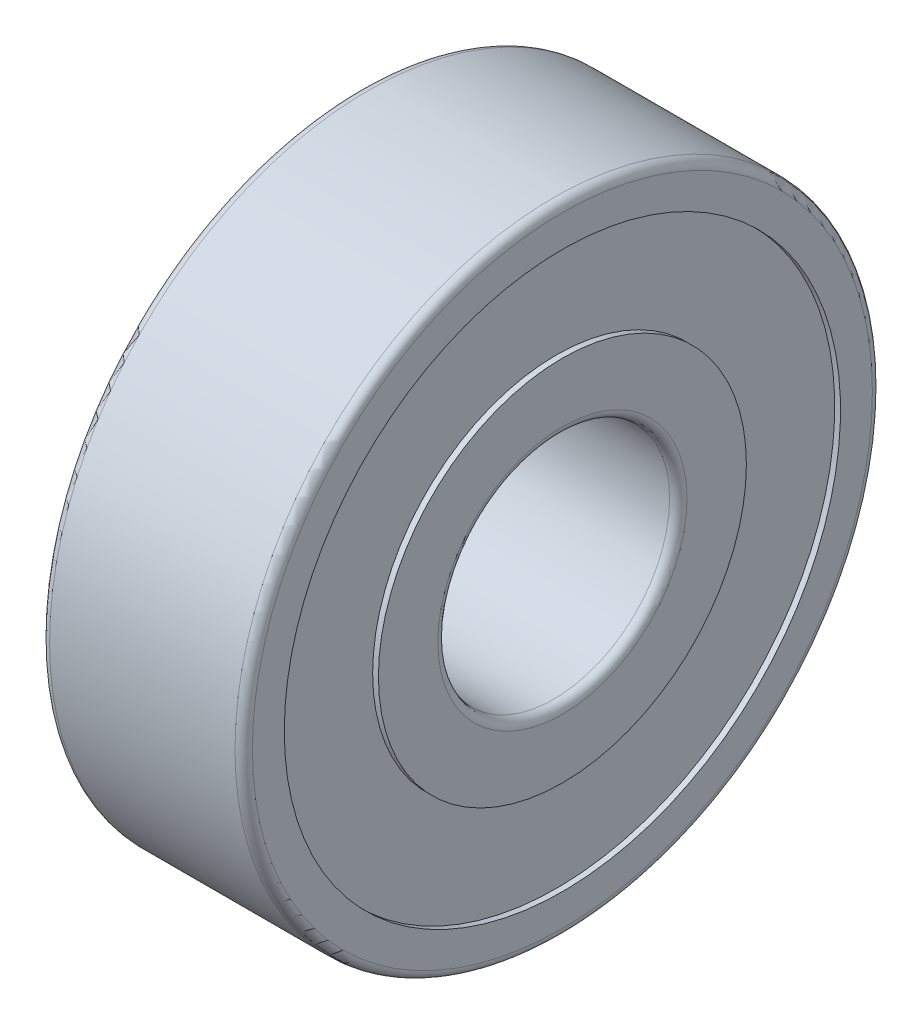
ISO-10303-21;
HEADER;
FILE_DESCRIPTION(('STEP AP214'),'2;1');
FILE_NAME('part.step','',(''),(''),'','','');
FILE_SCHEMA(('AUTOMOTIVE_DESIGN { 1 0 10303 214 1 1 1 1 }'));
ENDSEC;
DATA;
#1=APPLICATION_CONTEXT('core data for automotive mechanical design processes');
#2=APPLICATION_PROTOCOL_DEFINITION('international standard','automotive_design',2000,#1);
#3=PRODUCT_CONTEXT('',#1,'mechanical');
#4=PRODUCT('Part','Part','',(#3));
#5=PRODUCT_RELATED_PRODUCT_CATEGORY('part','',(#4));
#6=PRODUCT_DEFINITION_FORMATION('','',#4);
#7=PRODUCT_DEFINITION_CONTEXT('part definition',#1,'design');
#8=PRODUCT_DEFINITION('design','',#6,#7);
#9=PRODUCT_DEFINITION_SHAPE('','',#8);
#10=(LENGTH_UNIT() NAMED_UNIT(*) SI_UNIT(.MILLI.,.METRE.));
#11=(NAMED_UNIT(*) PLANE_ANGLE_UNIT() SI_UNIT($,.RADIAN.));
#12=(NAMED_UNIT(*) SI_UNIT($,.STERADIAN.) SOLID_ANGLE_UNIT());
#13=UNCERTAINTY_MEASURE_WITH_UNIT(LENGTH_MEASURE(1.E-05),#10,'distance_accuracy_value','');
#14=(GEOMETRIC_REPRESENTATION_CONTEXT(3) GLOBAL_UNCERTAINTY_ASSIGNED_CONTEXT((#13)) GLOBAL_UNIT_ASSIGNED_CONTEXT((#10,
#11,#12)) REPRESENTATION_CONTEXT('',''));
#15=CARTESIAN_POINT('',(0.,0.,0.));
#16=DIRECTION('',(0.,0.,1.));
#17=DIRECTION('',(1.,0.,0.));
#18=AXIS2_PLACEMENT_3D('',#15,#16,#17);
#19=CARTESIAN_POINT('',(50.,0.,0.));
#20=DIRECTION('',(-1.,0.,0.));
#21=DIRECTION('',(0.,0.,1.));
#22=AXIS2_PLACEMENT_3D('',#19,#20,#21);
#23=CYLINDRICAL_SURFACE('',#22,4.);
#24=CARTESIAN_POINT('',(0.300000000000002,0.,0.));
#25=DIRECTION('',(1.,0.,0.));
#26=DIRECTION('',(0.,0.,-1.));
#27=AXIS2_PLACEMENT_3D('',#24,#25,#26);
#28=CIRCLE('',#27,4.);
#29=CARTESIAN_POINT('',(0.300000000000002,0.,-4.));
#30=VERTEX_POINT('',#29);
#31=EDGE_CURVE('E161',#30,#30,#28,.T.);
#32=ORIENTED_EDGE('',*,*,#31,.F.);
#33=EDGE_LOOP('',(#32));
#34=FACE_BOUND('',#33,.T.);
#35=CARTESIAN_POINT('',(6.7,0.,0.));
#36=DIRECTION('',(1.,0.,0.));
#37=DIRECTION('',(0.,0.,-1.));
#38=AXIS2_PLACEMENT_3D('',#35,#36,#37);
#39=CIRCLE('',#38,4.);
#40=CARTESIAN_POINT('',(6.7,0.,-4.));
#41=VERTEX_POINT('',#40);
#42=EDGE_CURVE('E140',#41,#41,#39,.F.);
#43=ORIENTED_EDGE('',*,*,#42,.F.);
#44=EDGE_LOOP('',(#43));
#45=FACE_BOUND('',#44,.T.);
#46=ADVANCED_FACE('F15',(#34,#45),#23,.F.);
#47=CARTESIAN_POINT('',(0.300000000000002,0.,0.));
#48=DIRECTION('',(1.,0.,0.));
#49=DIRECTION('',(0.,0.,-1.));
#50=AXIS2_PLACEMENT_3D('',#47,#48,#49);
#51=TOROIDAL_SURFACE('',#50,4.3,0.3);
#52=CARTESIAN_POINT('',(0.,0.,0.));
#53=DIRECTION('',(-1.,0.,0.));
#54=DIRECTION('',(0.,0.,-1.));
#55=AXIS2_PLACEMENT_3D('',#52,#53,#54);
#56=CIRCLE('',#55,4.3);
#57=CARTESIAN_POINT('',(0.,0.,-4.3));
#58=VERTEX_POINT('',#57);
#59=EDGE_CURVE('E129',#58,#58,#56,.F.);
#60=ORIENTED_EDGE('',*,*,#59,.F.);
#61=EDGE_LOOP('',(#60));
#62=FACE_BOUND('',#61,.T.);
#63=ORIENTED_EDGE('',*,*,#31,.T.);
#64=EDGE_LOOP('',(#63));
#65=FACE_BOUND('',#64,.T.);
#66=ADVANCED_FACE('F145',(#62,#65),#51,.T.);
#67=CARTESIAN_POINT('',(6.7,0.,0.));
#68=DIRECTION('',(1.,0.,0.));
#69=DIRECTION('',(0.,0.,-1.));
#70=AXIS2_PLACEMENT_3D('',#67,#68,#69);
#71=TOROIDAL_SURFACE('',#70,4.3,0.3);
#72=ORIENTED_EDGE('',*,*,#42,.T.);
#73=EDGE_LOOP('',(#72));
#74=FACE_BOUND('',#73,.T.);
#75=CARTESIAN_POINT('',(7.,0.,0.));
#76=DIRECTION('',(1.,0.,0.));
#77=DIRECTION('',(0.,0.,-1.));
#78=AXIS2_PLACEMENT_3D('',#75,#76,#77);
#79=CIRCLE('',#78,4.3);
#80=CARTESIAN_POINT('',(7.,0.,-4.3));
#81=VERTEX_POINT('',#80);
#82=EDGE_CURVE('E212',#81,#81,#79,.F.);
#83=ORIENTED_EDGE('',*,*,#82,.F.);
#84=EDGE_LOOP('',(#83));
#85=FACE_BOUND('',#84,.T.);
#86=ADVANCED_FACE('F142',(#74,#85),#71,.T.);
#87=CARTESIAN_POINT('',(0.,6.35,0.));
#88=DIRECTION('',(-1.,0.,0.));
#89=DIRECTION('',(0.,0.,1.));
#90=AXIS2_PLACEMENT_3D('',#87,#88,#89);
#91=PLANE('',#90);
#92=CARTESIAN_POINT('',(0.,0.,0.));
#93=DIRECTION('',(-1.,0.,0.));
#94=DIRECTION('',(0.,0.,1.));
#95=AXIS2_PLACEMENT_3D('',#92,#93,#94);
#96=CIRCLE('',#95,6.35);
#97=CARTESIAN_POINT('',(0.,0.,6.35));
#98=VERTEX_POINT('',#97);
#99=EDGE_CURVE('E209',#98,#98,#96,.F.);
#100=ORIENTED_EDGE('',*,*,#99,.F.);
#101=EDGE_LOOP('',(#100));
#102=FACE_BOUND('',#101,.T.);
#103=ORIENTED_EDGE('',*,*,#59,.T.);
#104=EDGE_LOOP('',(#103));
#105=FACE_BOUND('',#104,.T.);
#106=ADVANCED_FACE('F110',(#102,#105),#91,.T.);
#107=CARTESIAN_POINT('',(7.,4.3,0.));
#108=DIRECTION('',(1.,0.,0.));
#109=DIRECTION('',(0.,0.,-1.));
#110=AXIS2_PLACEMENT_3D('',#107,#108,#109);
#111=PLANE('',#110);
#112=ORIENTED_EDGE('',*,*,#82,.T.);
#113=EDGE_LOOP('',(#112));
#114=FACE_BOUND('',#113,.T.);
#115=CARTESIAN_POINT('',(7.,0.,0.));
#116=DIRECTION('',(-1.,0.,0.));
#117=DIRECTION('',(0.,0.,1.));
#118=AXIS2_PLACEMENT_3D('',#115,#116,#117);
#119=CIRCLE('',#118,6.35);
#120=CARTESIAN_POINT('',(7.,0.,6.35));
#121=VERTEX_POINT('',#120);
#122=EDGE_CURVE('E204',#121,#121,#119,.T.);
#123=ORIENTED_EDGE('',*,*,#122,.F.);
#124=EDGE_LOOP('',(#123));
#125=FACE_BOUND('',#124,.T.);
#126=ADVANCED_FACE('F105',(#114,#125),#111,.T.);
#127=CARTESIAN_POINT('',(50.,0.,0.));
#128=DIRECTION('',(-1.,0.,0.));
#129=DIRECTION('',(0.,0.,1.));
#130=AXIS2_PLACEMENT_3D('',#127,#128,#129);
#131=CYLINDRICAL_SURFACE('',#130,6.35);
#132=CARTESIAN_POINT('',(0.200000000000006,0.,0.));
#133=DIRECTION('',(-1.,0.,0.));
#134=DIRECTION('',(0.,0.,1.));
#135=AXIS2_PLACEMENT_3D('',#132,#133,#134);
#136=CIRCLE('',#135,6.35);
#137=CARTESIAN_POINT('',(0.200000000000006,0.,6.35));
#138=VERTEX_POINT('',#137);
#139=EDGE_CURVE('E199',#138,#138,#136,.F.);
#140=ORIENTED_EDGE('',*,*,#139,.F.);
#141=EDGE_LOOP('',(#140));
#142=FACE_BOUND('',#141,.T.);
#143=ORIENTED_EDGE('',*,*,#99,.T.);
#144=EDGE_LOOP('',(#143));
#145=FACE_BOUND('',#144,.T.);
#146=ADVANCED_FACE('F101',(#142,#145),#131,.T.);
#147=CARTESIAN_POINT('',(50.,0.,0.));
#148=DIRECTION('',(-1.,0.,0.));
#149=DIRECTION('',(0.,0.,1.));
#150=AXIS2_PLACEMENT_3D('',#147,#148,#149);
#151=CYLINDRICAL_SURFACE('',#150,6.35);
#152=ORIENTED_EDGE('',*,*,#122,.T.);
#153=EDGE_LOOP('',(#152));
#154=FACE_BOUND('',#153,.T.);
#155=CARTESIAN_POINT('',(6.8,0.,0.));
#156=DIRECTION('',(-1.,0.,0.));
#157=DIRECTION('',(0.,0.,1.));
#158=AXIS2_PLACEMENT_3D('',#155,#156,#157);
#159=CIRCLE('',#158,6.35);
#160=CARTESIAN_POINT('',(6.8,0.,6.35));
#161=VERTEX_POINT('',#160);
#162=EDGE_CURVE('E194',#161,#161,#159,.T.);
#163=ORIENTED_EDGE('',*,*,#162,.F.);
#164=EDGE_LOOP('',(#163));
#165=FACE_BOUND('',#164,.T.);
#166=ADVANCED_FACE('F97',(#154,#165),#151,.T.);
#167=CARTESIAN_POINT('',(0.200000000000003,9.6,0.));
#168=DIRECTION('',(-1.,0.,0.));
#169=DIRECTION('',(0.,0.,1.));
#170=AXIS2_PLACEMENT_3D('',#167,#168,#169);
#171=PLANE('',#170);
#172=CARTESIAN_POINT('',(0.200000000000006,0.,0.));
#173=DIRECTION('',(-1.,0.,0.));
#174=DIRECTION('',(0.,0.,1.));
#175=AXIS2_PLACEMENT_3D('',#172,#173,#174);
#176=CIRCLE('',#175,9.6);
#177=CARTESIAN_POINT('',(0.200000000000006,0.,9.6));
#178=VERTEX_POINT('',#177);
#179=EDGE_CURVE('E189',#178,#178,#176,.T.);
#180=ORIENTED_EDGE('',*,*,#179,.T.);
#181=EDGE_LOOP('',(#180));
#182=FACE_BOUND('',#181,.T.);
#183=ORIENTED_EDGE('',*,*,#139,.T.);
#184=EDGE_LOOP('',(#183));
#185=FACE_BOUND('',#184,.T.);
#186=ADVANCED_FACE('F93',(#182,#185),#171,.T.);
#187=CARTESIAN_POINT('',(6.8,6.35,0.));
#188=DIRECTION('',(1.,0.,0.));
#189=DIRECTION('',(0.,0.,-1.));
#190=AXIS2_PLACEMENT_3D('',#187,#188,#189);
#191=PLANE('',#190);
#192=ORIENTED_EDGE('',*,*,#162,.T.);
#193=EDGE_LOOP('',(#192));
#194=FACE_BOUND('',#193,.T.);
#195=CARTESIAN_POINT('',(6.8,0.,0.));
#196=DIRECTION('',(-1.,0.,0.));
#197=DIRECTION('',(0.,0.,1.));
#198=AXIS2_PLACEMENT_3D('',#195,#196,#197);
#199=CIRCLE('',#198,9.6);
#200=CARTESIAN_POINT('',(6.8,0.,9.6));
#201=VERTEX_POINT('',#200);
#202=EDGE_CURVE('E184',#201,#201,#199,.F.);
#203=ORIENTED_EDGE('',*,*,#202,.T.);
#204=EDGE_LOOP('',(#203));
#205=FACE_BOUND('',#204,.T.);
#206=ADVANCED_FACE('F89',(#194,#205),#191,.T.);
#207=CARTESIAN_POINT('',(50.,0.,0.));
#208=DIRECTION('',(-1.,0.,0.));
#209=DIRECTION('',(0.,0.,1.));
#210=AXIS2_PLACEMENT_3D('',#207,#208,#209);
#211=CYLINDRICAL_SURFACE('',#210,9.6);
#212=CARTESIAN_POINT('',(0.,0.,0.));
#213=DIRECTION('',(-1.,0.,0.));
#214=DIRECTION('',(0.,0.,1.));
#215=AXIS2_PLACEMENT_3D('',#212,#213,#214);
#216=CIRCLE('',#215,9.6);
#217=CARTESIAN_POINT('',(0.,0.,9.6));
#218=VERTEX_POINT('',#217);
#219=EDGE_CURVE('E179',#218,#218,#216,.F.);
#220=ORIENTED_EDGE('',*,*,#219,.F.);
#221=EDGE_LOOP('',(#220));
#222=FACE_BOUND('',#221,.T.);
#223=ORIENTED_EDGE('',*,*,#179,.F.);
#224=EDGE_LOOP('',(#223));
#225=FACE_BOUND('',#224,.T.);
#226=ADVANCED_FACE('F85',(#222,#225),#211,.F.);
#227=CARTESIAN_POINT('',(50.,0.,0.));
#228=DIRECTION('',(-1.,0.,0.));
#229=DIRECTION('',(0.,0.,1.));
#230=AXIS2_PLACEMENT_3D('',#227,#228,#229);
#231=CYLINDRICAL_SURFACE('',#230,9.6);
#232=ORIENTED_EDGE('',*,*,#202,.F.);
#233=EDGE_LOOP('',(#232));
#234=FACE_BOUND('',#233,.T.);
#235=CARTESIAN_POINT('',(6.99999999999999,0.,0.));
#236=DIRECTION('',(-1.,0.,0.));
#237=DIRECTION('',(0.,0.,1.));
#238=AXIS2_PLACEMENT_3D('',#235,#236,#237);
#239=CIRCLE('',#238,9.6);
#240=CARTESIAN_POINT('',(6.99999999999999,0.,9.6));
#241=VERTEX_POINT('',#240);
#242=EDGE_CURVE('E171',#241,#241,#239,.T.);
#243=ORIENTED_EDGE('',*,*,#242,.F.);
#244=EDGE_LOOP('',(#243));
#245=FACE_BOUND('',#244,.T.);
#246=ADVANCED_FACE('F81',(#234,#245),#231,.F.);
#247=CARTESIAN_POINT('',(0.,10.7,0.));
#248=DIRECTION('',(-1.,0.,0.));
#249=DIRECTION('',(0.,0.,1.));
#250=AXIS2_PLACEMENT_3D('',#247,#248,#249);
#251=PLANE('',#250);
#252=CARTESIAN_POINT('',(0.,0.,0.));
#253=DIRECTION('',(1.,0.,0.));
#254=DIRECTION('',(0.,0.,-1.));
#255=AXIS2_PLACEMENT_3D('',#252,#253,#254);
#256=CIRCLE('',#255,10.7);
#257=CARTESIAN_POINT('',(0.,0.,-10.7));
#258=VERTEX_POINT('',#257);
#259=EDGE_CURVE('E65',#258,#258,#256,.T.);
#260=ORIENTED_EDGE('',*,*,#259,.F.);
#261=EDGE_LOOP('',(#260));
#262=FACE_BOUND('',#261,.T.);
#263=ORIENTED_EDGE('',*,*,#219,.T.);
#264=EDGE_LOOP('',(#263));
#265=FACE_BOUND('',#264,.T.);
#266=ADVANCED_FACE('F71',(#262,#265),#251,.T.);
#267=CARTESIAN_POINT('',(6.99999999999999,9.6,0.));
#268=DIRECTION('',(1.,0.,0.));
#269=DIRECTION('',(0.,0.,-1.));
#270=AXIS2_PLACEMENT_3D('',#267,#268,#269);
#271=PLANE('',#270);
#272=ORIENTED_EDGE('',*,*,#242,.T.);
#273=EDGE_LOOP('',(#272));
#274=FACE_BOUND('',#273,.T.);
#275=CARTESIAN_POINT('',(6.99999999999999,0.,0.));
#276=DIRECTION('',(-1.,0.,0.));
#277=DIRECTION('',(0.,0.,-1.));
#278=AXIS2_PLACEMENT_3D('',#275,#276,#277);
#279=CIRCLE('',#278,10.7);
#280=CARTESIAN_POINT('',(6.99999999999999,0.,-10.7));
#281=VERTEX_POINT('',#280);
#282=EDGE_CURVE('E27',#281,#281,#279,.T.);
#283=ORIENTED_EDGE('',*,*,#282,.F.);
#284=EDGE_LOOP('',(#283));
#285=FACE_BOUND('',#284,.T.);
#286=ADVANCED_FACE('F80',(#274,#285),#271,.T.);
#287=CARTESIAN_POINT('',(0.299999999999999,0.,0.));
#288=DIRECTION('',(1.,0.,0.));
#289=DIRECTION('',(0.,0.,-1.));
#290=AXIS2_PLACEMENT_3D('',#287,#288,#289);
#291=TOROIDAL_SURFACE('',#290,10.7,0.3);
#292=CARTESIAN_POINT('',(0.300000000000002,0.,0.));
#293=DIRECTION('',(-1.,0.,0.));
#294=DIRECTION('',(0.,0.,1.));
#295=AXIS2_PLACEMENT_3D('',#292,#293,#294);
#296=CIRCLE('',#295,11.);
#297=CARTESIAN_POINT('',(0.300000000000002,0.,11.));
#298=VERTEX_POINT('',#297);
#299=EDGE_CURVE('E22',#298,#298,#296,.F.);
#300=ORIENTED_EDGE('',*,*,#299,.F.);
#301=EDGE_LOOP('',(#300));
#302=FACE_BOUND('',#301,.T.);
#303=ORIENTED_EDGE('',*,*,#259,.T.);
#304=EDGE_LOOP('',(#303));
#305=FACE_BOUND('',#304,.T.);
#306=ADVANCED_FACE('F45',(#302,#305),#291,.T.);
#307=CARTESIAN_POINT('',(6.69999999999999,0.,0.));
#308=DIRECTION('',(1.,0.,0.));
#309=DIRECTION('',(0.,0.,-1.));
#310=AXIS2_PLACEMENT_3D('',#307,#308,#309);
#311=TOROIDAL_SURFACE('',#310,10.7,0.3);
#312=ORIENTED_EDGE('',*,*,#282,.T.);
#313=EDGE_LOOP('',(#312));
#314=FACE_BOUND('',#313,.T.);
#315=CARTESIAN_POINT('',(6.69999999999999,0.,0.));
#316=DIRECTION('',(-1.,0.,0.));
#317=DIRECTION('',(0.,0.,1.));
#318=AXIS2_PLACEMENT_3D('',#315,#316,#317);
#319=CIRCLE('',#318,11.);
#320=CARTESIAN_POINT('',(6.69999999999999,0.,11.));
#321=VERTEX_POINT('',#320);
#322=EDGE_CURVE('E10',#321,#321,#319,.T.);
#323=ORIENTED_EDGE('',*,*,#322,.F.);
#324=EDGE_LOOP('',(#323));
#325=FACE_BOUND('',#324,.T.);
#326=ADVANCED_FACE('F39',(#314,#325),#311,.T.);
#327=CARTESIAN_POINT('',(50.,0.,0.));
#328=DIRECTION('',(-1.,0.,0.));
#329=DIRECTION('',(0.,0.,1.));
#330=AXIS2_PLACEMENT_3D('',#327,#328,#329);
#331=CYLINDRICAL_SURFACE('',#330,11.);
#332=ORIENTED_EDGE('',*,*,#322,.T.);
#333=EDGE_LOOP('',(#332));
#334=FACE_BOUND('',#333,.T.);
#335=ORIENTED_EDGE('',*,*,#299,.T.);
#336=EDGE_LOOP('',(#335));
#337=FACE_BOUND('',#336,.T.);
#338=ADVANCED_FACE('F44',(#334,#337),#331,.T.);
#339=CLOSED_SHELL('',(#46,#66,#86,#106,#126,#146,#166,#186,#206,#226,#246,#266,#286,#306,#326,#338));
#340=MANIFOLD_SOLID_BREP('B1',#339);
#341=ADVANCED_BREP_SHAPE_REPRESENTATION('',(#18,#340),#14);
#342=SHAPE_DEFINITION_REPRESENTATION(#9,#341);
ENDSEC;
END-ISO-10303-21;
